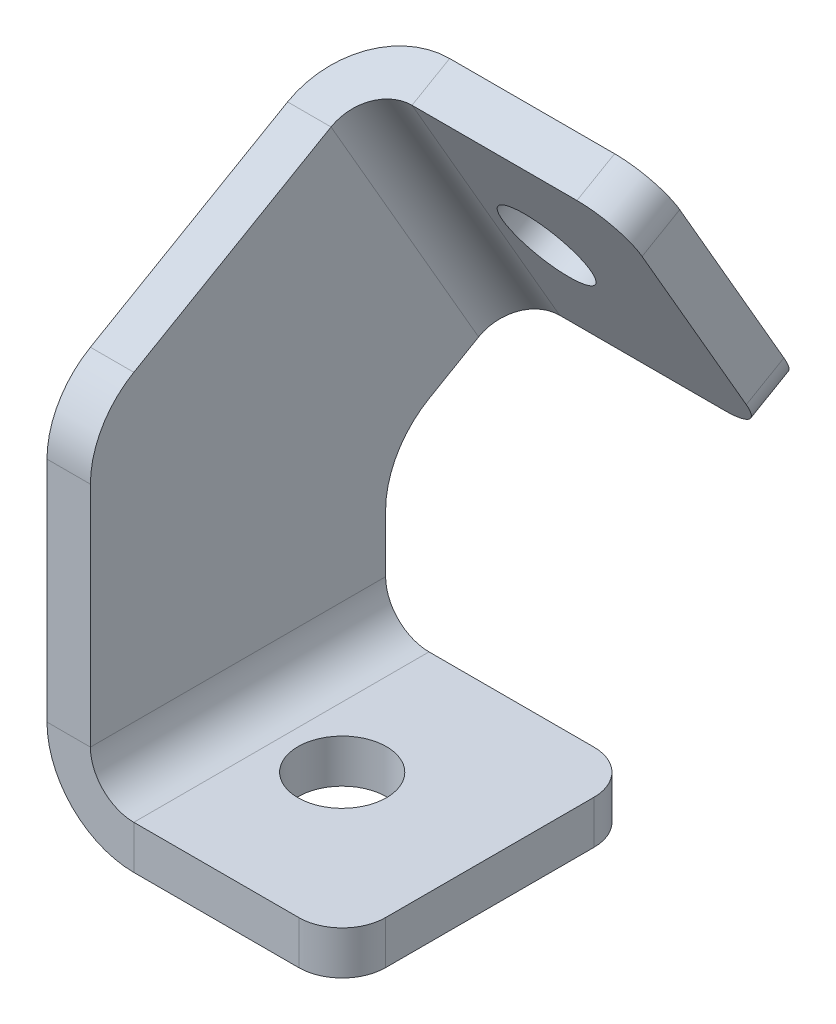
ISO-10303-21;
HEADER;
FILE_DESCRIPTION(('STEP AP214'),'2;1');
FILE_NAME('part.step','',(''),(''),'','','');
FILE_SCHEMA(('AUTOMOTIVE_DESIGN { 1 0 10303 214 1 1 1 1 }'));
ENDSEC;
DATA;
#1=APPLICATION_CONTEXT('core data for automotive mechanical design processes');
#2=APPLICATION_PROTOCOL_DEFINITION('international standard','automotive_design',2000,#1);
#3=PRODUCT_CONTEXT('',#1,'mechanical');
#4=PRODUCT('Part','Part','',(#3));
#5=PRODUCT_RELATED_PRODUCT_CATEGORY('part','',(#4));
#6=PRODUCT_DEFINITION_FORMATION('','',#4);
#7=PRODUCT_DEFINITION_CONTEXT('part definition',#1,'design');
#8=PRODUCT_DEFINITION('design','',#6,#7);
#9=PRODUCT_DEFINITION_SHAPE('','',#8);
#10=(LENGTH_UNIT() NAMED_UNIT(*) SI_UNIT(.MILLI.,.METRE.));
#11=(NAMED_UNIT(*) PLANE_ANGLE_UNIT() SI_UNIT($,.RADIAN.));
#12=(NAMED_UNIT(*) SI_UNIT($,.STERADIAN.) SOLID_ANGLE_UNIT());
#13=UNCERTAINTY_MEASURE_WITH_UNIT(LENGTH_MEASURE(1.E-05),#10,'distance_accuracy_value','');
#14=(GEOMETRIC_REPRESENTATION_CONTEXT(3) GLOBAL_UNCERTAINTY_ASSIGNED_CONTEXT((#13)) GLOBAL_UNIT_ASSIGNED_CONTEXT((#10,
#11,#12)) REPRESENTATION_CONTEXT('',''));
#15=CARTESIAN_POINT('',(0.,0.,0.));
#16=DIRECTION('',(0.,0.,1.));
#17=DIRECTION('',(1.,0.,0.));
#18=AXIS2_PLACEMENT_3D('',#15,#16,#17);
#19=CARTESIAN_POINT('',(2.5,18.1132486540519,12.));
#20=DIRECTION('',(1.,0.,0.));
#21=DIRECTION('',(0.,0.,-1.));
#22=AXIS2_PLACEMENT_3D('',#19,#20,#21);
#23=CYLINDRICAL_SURFACE('',#22,5.);
#24=DIRECTION('',(1.,0.,0.));
#25=VECTOR('',#24,1.);
#26=CARTESIAN_POINT('',(2.5,22.4433756729741,14.5));
#27=LINE('',#26,#25);
#28=CARTESIAN_POINT('',(0.,22.4433756729741,14.5));
#29=VERTEX_POINT('',#28);
#30=CARTESIAN_POINT('',(2.5,22.4433756729741,14.5));
#31=VERTEX_POINT('',#30);
#32=EDGE_CURVE('E10',#29,#31,#27,.T.);
#33=ORIENTED_EDGE('',*,*,#32,.F.);
#34=CARTESIAN_POINT('',(0.,18.1132486540519,12.));
#35=DIRECTION('',(1.,0.,0.));
#36=DIRECTION('',(0.,0.,-1.));
#37=AXIS2_PLACEMENT_3D('',#34,#35,#36);
#38=CIRCLE('',#37,5.);
#39=CARTESIAN_POINT('',(0.,18.1132486540519,17.));
#40=VERTEX_POINT('',#39);
#41=EDGE_CURVE('E136',#29,#40,#38,.T.);
#42=ORIENTED_EDGE('',*,*,#41,.T.);
#43=DIRECTION('',(1.,0.,0.));
#44=VECTOR('',#43,1.);
#45=CARTESIAN_POINT('',(2.5,18.1132486540519,17.));
#46=LINE('',#45,#44);
#47=CARTESIAN_POINT('',(2.5,18.1132486540519,17.));
#48=VERTEX_POINT('',#47);
#49=EDGE_CURVE('E26',#40,#48,#46,.T.);
#50=ORIENTED_EDGE('',*,*,#49,.T.);
#51=CARTESIAN_POINT('',(2.5,18.1132486540519,12.));
#52=DIRECTION('',(1.,0.,0.));
#53=DIRECTION('',(0.,0.,-1.));
#54=AXIS2_PLACEMENT_3D('',#51,#52,#53);
#55=CIRCLE('',#54,5.);
#56=EDGE_CURVE('E254',#31,#48,#55,.T.);
#57=ORIENTED_EDGE('',*,*,#56,.F.);
#58=EDGE_LOOP('',(#33,#42,#50,#57));
#59=FACE_BOUND('',#58,.T.);
#60=ADVANCED_FACE('F16',(#59),#23,.T.);
#61=CARTESIAN_POINT('',(2.5,0.,17.));
#62=DIRECTION('',(0.,0.,-1.));
#63=DIRECTION('',(0.,1.,0.));
#64=AXIS2_PLACEMENT_3D('',#61,#62,#63);
#65=PLANE('',#64);
#66=ORIENTED_EDGE('',*,*,#49,.F.);
#67=DIRECTION('',(0.,1.,0.));
#68=VECTOR('',#67,1.);
#69=CARTESIAN_POINT('',(0.,0.,17.));
#70=LINE('',#69,#68);
#71=CARTESIAN_POINT('',(0.,5.,17.));
#72=VERTEX_POINT('',#71);
#73=EDGE_CURVE('E195',#40,#72,#70,.F.);
#74=ORIENTED_EDGE('',*,*,#73,.T.);
#75=DIRECTION('',(1.,0.,0.));
#76=VECTOR('',#75,1.);
#77=CARTESIAN_POINT('',(2.5,5.,17.));
#78=LINE('',#77,#76);
#79=CARTESIAN_POINT('',(2.5,5.,17.));
#80=VERTEX_POINT('',#79);
#81=EDGE_CURVE('E247',#72,#80,#78,.T.);
#82=ORIENTED_EDGE('',*,*,#81,.T.);
#83=DIRECTION('',(0.,1.,0.));
#84=VECTOR('',#83,1.);
#85=CARTESIAN_POINT('',(2.5,0.,17.));
#86=LINE('',#85,#84);
#87=EDGE_CURVE('E264',#48,#80,#86,.F.);
#88=ORIENTED_EDGE('',*,*,#87,.F.);
#89=EDGE_LOOP('',(#66,#74,#82,#88));
#90=FACE_BOUND('',#89,.T.);
#91=ADVANCED_FACE('F267',(#90),#65,.F.);
#92=CARTESIAN_POINT('',(5.,5.,17.));
#93=DIRECTION('',(0.,0.,1.));
#94=DIRECTION('',(1.,0.,0.));
#95=AXIS2_PLACEMENT_3D('',#92,#93,#94);
#96=PLANE('',#95);
#97=ORIENTED_EDGE('',*,*,#81,.F.);
#98=CARTESIAN_POINT('',(5.,5.,17.));
#99=DIRECTION('',(0.,0.,1.));
#100=DIRECTION('',(1.,0.,0.));
#101=AXIS2_PLACEMENT_3D('',#98,#99,#100);
#102=CIRCLE('',#101,5.);
#103=CARTESIAN_POINT('',(5.,0.,17.));
#104=VERTEX_POINT('',#103);
#105=EDGE_CURVE('E170',#104,#72,#102,.F.);
#106=ORIENTED_EDGE('',*,*,#105,.F.);
#107=DIRECTION('',(0.,1.,0.));
#108=VECTOR('',#107,1.);
#109=CARTESIAN_POINT('',(5.,2.5,17.));
#110=LINE('',#109,#108);
#111=CARTESIAN_POINT('',(5.,2.5,17.));
#112=VERTEX_POINT('',#111);
#113=EDGE_CURVE('E244',#104,#112,#110,.T.);
#114=ORIENTED_EDGE('',*,*,#113,.T.);
#115=CARTESIAN_POINT('',(5.,5.,17.));
#116=DIRECTION('',(0.,0.,-1.));
#117=DIRECTION('',(-1.,0.,0.));
#118=AXIS2_PLACEMENT_3D('',#115,#116,#117);
#119=CIRCLE('',#118,2.5);
#120=EDGE_CURVE('E279',#112,#80,#119,.T.);
#121=ORIENTED_EDGE('',*,*,#120,.T.);
#122=EDGE_LOOP('',(#97,#106,#114,#121));
#123=FACE_BOUND('',#122,.T.);
#124=ADVANCED_FACE('F336',(#123),#96,.T.);
#125=CARTESIAN_POINT('',(0.,2.5,17.));
#126=DIRECTION('',(0.,0.,1.));
#127=DIRECTION('',(1.,0.,0.));
#128=AXIS2_PLACEMENT_3D('',#125,#126,#127);
#129=PLANE('',#128);
#130=ORIENTED_EDGE('',*,*,#113,.F.);
#131=DIRECTION('',(1.,0.,0.));
#132=VECTOR('',#131,1.);
#133=CARTESIAN_POINT('',(0.,0.,17.));
#134=LINE('',#133,#132);
#135=CARTESIAN_POINT('',(14.5,0.,17.));
#136=VERTEX_POINT('',#135);
#137=EDGE_CURVE('E190',#104,#136,#134,.T.);
#138=ORIENTED_EDGE('',*,*,#137,.T.);
#139=DIRECTION('',(0.,1.,0.));
#140=VECTOR('',#139,1.);
#141=CARTESIAN_POINT('',(14.5,2.5,17.));
#142=LINE('',#141,#140);
#143=CARTESIAN_POINT('',(14.5,2.5,17.));
#144=VERTEX_POINT('',#143);
#145=EDGE_CURVE('E241',#136,#144,#142,.T.);
#146=ORIENTED_EDGE('',*,*,#145,.T.);
#147=DIRECTION('',(1.,0.,0.));
#148=VECTOR('',#147,1.);
#149=CARTESIAN_POINT('',(0.,2.5,17.));
#150=LINE('',#149,#148);
#151=EDGE_CURVE('E388',#112,#144,#150,.T.);
#152=ORIENTED_EDGE('',*,*,#151,.F.);
#153=EDGE_LOOP('',(#130,#138,#146,#152));
#154=FACE_BOUND('',#153,.T.);
#155=ADVANCED_FACE('F619',(#154),#129,.T.);
#156=CARTESIAN_POINT('',(14.5,2.5,14.5));
#157=DIRECTION('',(0.,1.,0.));
#158=DIRECTION('',(0.,0.,1.));
#159=AXIS2_PLACEMENT_3D('',#156,#157,#158);
#160=CYLINDRICAL_SURFACE('',#159,2.5);
#161=ORIENTED_EDGE('',*,*,#145,.F.);
#162=CARTESIAN_POINT('',(14.5,0.,14.5));
#163=DIRECTION('',(0.,1.,0.));
#164=DIRECTION('',(0.,0.,1.));
#165=AXIS2_PLACEMENT_3D('',#162,#163,#164);
#166=CIRCLE('',#165,2.5);
#167=CARTESIAN_POINT('',(17.,0.,14.5));
#168=VERTEX_POINT('',#167);
#169=EDGE_CURVE('E166',#136,#168,#166,.T.);
#170=ORIENTED_EDGE('',*,*,#169,.T.);
#171=DIRECTION('',(0.,1.,0.));
#172=VECTOR('',#171,1.);
#173=CARTESIAN_POINT('',(17.,2.5,14.5));
#174=LINE('',#173,#172);
#175=CARTESIAN_POINT('',(17.,2.5,14.5));
#176=VERTEX_POINT('',#175);
#177=EDGE_CURVE('E238',#168,#176,#174,.T.);
#178=ORIENTED_EDGE('',*,*,#177,.T.);
#179=CARTESIAN_POINT('',(14.5,2.5,14.5));
#180=DIRECTION('',(0.,1.,0.));
#181=DIRECTION('',(0.,0.,1.));
#182=AXIS2_PLACEMENT_3D('',#179,#180,#181);
#183=CIRCLE('',#182,2.5);
#184=EDGE_CURVE('E384',#144,#176,#183,.T.);
#185=ORIENTED_EDGE('',*,*,#184,.F.);
#186=EDGE_LOOP('',(#161,#170,#178,#185));
#187=FACE_BOUND('',#186,.T.);
#188=ADVANCED_FACE('F624',(#187),#160,.T.);
#189=CARTESIAN_POINT('',(17.,2.5,17.));
#190=DIRECTION('',(1.,0.,0.));
#191=DIRECTION('',(0.,0.,-1.));
#192=AXIS2_PLACEMENT_3D('',#189,#190,#191);
#193=PLANE('',#192);
#194=ORIENTED_EDGE('',*,*,#177,.F.);
#195=DIRECTION('',(0.,0.,1.));
#196=VECTOR('',#195,1.);
#197=CARTESIAN_POINT('',(17.,0.,17.));
#198=LINE('',#197,#196);
#199=CARTESIAN_POINT('',(17.,0.,2.5));
#200=VERTEX_POINT('',#199);
#201=EDGE_CURVE('E184',#168,#200,#198,.F.);
#202=ORIENTED_EDGE('',*,*,#201,.T.);
#203=DIRECTION('',(0.,1.,0.));
#204=VECTOR('',#203,1.);
#205=CARTESIAN_POINT('',(17.,2.5,2.5));
#206=LINE('',#205,#204);
#207=CARTESIAN_POINT('',(17.,2.5,2.5));
#208=VERTEX_POINT('',#207);
#209=EDGE_CURVE('E235',#200,#208,#206,.T.);
#210=ORIENTED_EDGE('',*,*,#209,.T.);
#211=DIRECTION('',(0.,0.,-1.));
#212=VECTOR('',#211,1.);
#213=CARTESIAN_POINT('',(17.,2.5,17.));
#214=LINE('',#213,#212);
#215=EDGE_CURVE('E401',#176,#208,#214,.T.);
#216=ORIENTED_EDGE('',*,*,#215,.F.);
#217=EDGE_LOOP('',(#194,#202,#210,#216));
#218=FACE_BOUND('',#217,.T.);
#219=ADVANCED_FACE('F650',(#218),#193,.T.);
#220=CARTESIAN_POINT('',(14.5,2.5,2.5));
#221=DIRECTION('',(0.,1.,0.));
#222=DIRECTION('',(0.,0.,1.));
#223=AXIS2_PLACEMENT_3D('',#220,#221,#222);
#224=CYLINDRICAL_SURFACE('',#223,2.5);
#225=ORIENTED_EDGE('',*,*,#209,.F.);
#226=CARTESIAN_POINT('',(14.5,0.,2.5));
#227=DIRECTION('',(0.,1.,0.));
#228=DIRECTION('',(0.,0.,1.));
#229=AXIS2_PLACEMENT_3D('',#226,#227,#228);
#230=CIRCLE('',#229,2.5);
#231=CARTESIAN_POINT('',(14.5,0.,0.));
#232=VERTEX_POINT('',#231);
#233=EDGE_CURVE('E181',#200,#232,#230,.T.);
#234=ORIENTED_EDGE('',*,*,#233,.T.);
#235=DIRECTION('',(0.,1.,0.));
#236=VECTOR('',#235,1.);
#237=CARTESIAN_POINT('',(14.5,2.5,0.));
#238=LINE('',#237,#236);
#239=CARTESIAN_POINT('',(14.5,2.5,0.));
#240=VERTEX_POINT('',#239);
#241=EDGE_CURVE('E232',#232,#240,#238,.T.);
#242=ORIENTED_EDGE('',*,*,#241,.T.);
#243=CARTESIAN_POINT('',(14.5,2.5,2.5));
#244=DIRECTION('',(0.,1.,0.));
#245=DIRECTION('',(0.,0.,1.));
#246=AXIS2_PLACEMENT_3D('',#243,#244,#245);
#247=CIRCLE('',#246,2.5);
#248=EDGE_CURVE('E398',#208,#240,#247,.T.);
#249=ORIENTED_EDGE('',*,*,#248,.F.);
#250=EDGE_LOOP('',(#225,#234,#242,#249));
#251=FACE_BOUND('',#250,.T.);
#252=ADVANCED_FACE('F593',(#251),#224,.T.);
#253=CARTESIAN_POINT('',(0.,2.5,0.));
#254=DIRECTION('',(0.,0.,1.));
#255=DIRECTION('',(1.,0.,0.));
#256=AXIS2_PLACEMENT_3D('',#253,#254,#255);
#257=PLANE('',#256);
#258=ORIENTED_EDGE('',*,*,#241,.F.);
#259=DIRECTION('',(1.,0.,0.));
#260=VECTOR('',#259,1.);
#261=CARTESIAN_POINT('',(0.,0.,0.));
#262=LINE('',#261,#260);
#263=CARTESIAN_POINT('',(5.,0.,0.));
#264=VERTEX_POINT('',#263);
#265=EDGE_CURVE('E178',#264,#232,#262,.T.);
#266=ORIENTED_EDGE('',*,*,#265,.F.);
#267=DIRECTION('',(0.,1.,0.));
#268=VECTOR('',#267,1.);
#269=CARTESIAN_POINT('',(5.,2.5,0.));
#270=LINE('',#269,#268);
#271=CARTESIAN_POINT('',(5.,2.5,0.));
#272=VERTEX_POINT('',#271);
#273=EDGE_CURVE('E229',#264,#272,#270,.T.);
#274=ORIENTED_EDGE('',*,*,#273,.T.);
#275=DIRECTION('',(1.,0.,0.));
#276=VECTOR('',#275,1.);
#277=CARTESIAN_POINT('',(0.,2.5,0.));
#278=LINE('',#277,#276);
#279=EDGE_CURVE('E396',#272,#240,#278,.T.);
#280=ORIENTED_EDGE('',*,*,#279,.T.);
#281=EDGE_LOOP('',(#258,#266,#274,#280));
#282=FACE_BOUND('',#281,.T.);
#283=ADVANCED_FACE('F585',(#282),#257,.F.);
#284=CARTESIAN_POINT('',(5.,5.,0.));
#285=DIRECTION('',(0.,0.,1.));
#286=DIRECTION('',(1.,0.,0.));
#287=AXIS2_PLACEMENT_3D('',#284,#285,#286);
#288=PLANE('',#287);
#289=ORIENTED_EDGE('',*,*,#273,.F.);
#290=CARTESIAN_POINT('',(5.,5.,0.));
#291=DIRECTION('',(0.,0.,1.));
#292=DIRECTION('',(1.,0.,0.));
#293=AXIS2_PLACEMENT_3D('',#290,#291,#292);
#294=CIRCLE('',#293,5.);
#295=CARTESIAN_POINT('',(0.,5.,0.));
#296=VERTEX_POINT('',#295);
#297=EDGE_CURVE('E175',#296,#264,#294,.T.);
#298=ORIENTED_EDGE('',*,*,#297,.F.);
#299=DIRECTION('',(1.,0.,0.));
#300=VECTOR('',#299,1.);
#301=CARTESIAN_POINT('',(2.5,5.,0.));
#302=LINE('',#301,#300);
#303=CARTESIAN_POINT('',(2.5,5.,0.));
#304=VERTEX_POINT('',#303);
#305=EDGE_CURVE('E226',#296,#304,#302,.T.);
#306=ORIENTED_EDGE('',*,*,#305,.T.);
#307=CARTESIAN_POINT('',(5.,5.,0.));
#308=DIRECTION('',(0.,0.,-1.));
#309=DIRECTION('',(-1.,0.,0.));
#310=AXIS2_PLACEMENT_3D('',#307,#308,#309);
#311=CIRCLE('',#310,2.5);
#312=EDGE_CURVE('E281',#304,#272,#311,.F.);
#313=ORIENTED_EDGE('',*,*,#312,.T.);
#314=EDGE_LOOP('',(#289,#298,#306,#313));
#315=FACE_BOUND('',#314,.T.);
#316=ADVANCED_FACE('F319',(#315),#288,.F.);
#317=CARTESIAN_POINT('',(2.5,0.,0.));
#318=DIRECTION('',(0.,0.,-1.));
#319=DIRECTION('',(0.,1.,0.));
#320=AXIS2_PLACEMENT_3D('',#317,#318,#319);
#321=PLANE('',#320);
#322=ORIENTED_EDGE('',*,*,#305,.F.);
#323=DIRECTION('',(0.,1.,0.));
#324=VECTOR('',#323,1.);
#325=CARTESIAN_POINT('',(0.,0.,0.));
#326=LINE('',#325,#324);
#327=CARTESIAN_POINT('',(0.,8.2982940778282,0.));
#328=VERTEX_POINT('',#327);
#329=EDGE_CURVE('E171',#328,#296,#326,.F.);
#330=ORIENTED_EDGE('',*,*,#329,.F.);
#331=DIRECTION('',(1.,0.,0.));
#332=VECTOR('',#331,1.);
#333=CARTESIAN_POINT('',(2.5,8.2982940778282,0.));
#334=LINE('',#333,#332);
#335=CARTESIAN_POINT('',(2.5,8.2982940778282,0.));
#336=VERTEX_POINT('',#335);
#337=EDGE_CURVE('E223',#328,#336,#334,.T.);
#338=ORIENTED_EDGE('',*,*,#337,.T.);
#339=DIRECTION('',(0.,1.,0.));
#340=VECTOR('',#339,1.);
#341=CARTESIAN_POINT('',(2.5,0.,0.));
#342=LINE('',#341,#340);
#343=EDGE_CURVE('E270',#336,#304,#342,.F.);
#344=ORIENTED_EDGE('',*,*,#343,.T.);
#345=EDGE_LOOP('',(#322,#330,#338,#344));
#346=FACE_BOUND('',#345,.T.);
#347=ADVANCED_FACE('F569',(#346),#321,.T.);
#348=CARTESIAN_POINT('',(2.5,8.2982940778282,-5.));
#349=DIRECTION('',(1.,0.,0.));
#350=DIRECTION('',(0.,0.,-1.));
#351=AXIS2_PLACEMENT_3D('',#348,#349,#350);
#352=CYLINDRICAL_SURFACE('',#351,5.);
#353=ORIENTED_EDGE('',*,*,#337,.F.);
#354=CARTESIAN_POINT('',(0.,8.2982940778282,-5.));
#355=DIRECTION('',(1.,0.,0.));
#356=DIRECTION('',(0.,0.,-1.));
#357=AXIS2_PLACEMENT_3D('',#354,#355,#356);
#358=CIRCLE('',#357,5.);
#359=CARTESIAN_POINT('',(0.,12.6284210967504,-2.50000000000001));
#360=VERTEX_POINT('',#359);
#361=EDGE_CURVE('E167',#328,#360,#358,.F.);
#362=ORIENTED_EDGE('',*,*,#361,.T.);
#363=DIRECTION('',(1.,0.,0.));
#364=VECTOR('',#363,1.);
#365=CARTESIAN_POINT('',(2.5,12.6284210967504,-2.50000000000001));
#366=LINE('',#365,#364);
#367=CARTESIAN_POINT('',(2.5,12.6284210967504,-2.50000000000001));
#368=VERTEX_POINT('',#367);
#369=EDGE_CURVE('E220',#360,#368,#366,.T.);
#370=ORIENTED_EDGE('',*,*,#369,.T.);
#371=CARTESIAN_POINT('',(2.5,8.2982940778282,-5.));
#372=DIRECTION('',(1.,0.,0.));
#373=DIRECTION('',(0.,0.,-1.));
#374=AXIS2_PLACEMENT_3D('',#371,#372,#373);
#375=CIRCLE('',#374,5.);
#376=EDGE_CURVE('E276',#336,#368,#375,.F.);
#377=ORIENTED_EDGE('',*,*,#376,.F.);
#378=EDGE_LOOP('',(#353,#362,#370,#377));
#379=FACE_BOUND('',#378,.T.);
#380=ADVANCED_FACE('F561',(#379),#352,.F.);
#381=CARTESIAN_POINT('',(2.5,16.7775681356645,-9.6865334794732));
#382=DIRECTION('',(0.,0.86602540378444,0.499999999999998));
#383=DIRECTION('',(0.,-0.499999999999998,0.86602540378444));
#384=AXIS2_PLACEMENT_3D('',#381,#382,#383);
#385=PLANE('',#384);
#386=ORIENTED_EDGE('',*,*,#369,.F.);
#387=DIRECTION('',(0.,-0.499999999999998,0.86602540378444));
#388=VECTOR('',#387,1.);
#389=CARTESIAN_POINT('',(0.,16.7775681356645,-9.6865334794732));
#390=LINE('',#389,#388);
#391=CARTESIAN_POINT('',(0.,14.2775681356645,-5.35640646055101));
#392=VERTEX_POINT('',#391);
#393=EDGE_CURVE('E132',#360,#392,#390,.F.);
#394=ORIENTED_EDGE('',*,*,#393,.T.);
#395=DIRECTION('',(1.,0.,0.));
#396=VECTOR('',#395,1.);
#397=CARTESIAN_POINT('',(2.5,14.2775681356645,-5.35640646055101));
#398=LINE('',#397,#396);
#399=CARTESIAN_POINT('',(2.5,14.2775681356645,-5.35640646055101));
#400=VERTEX_POINT('',#399);
#401=EDGE_CURVE('E217',#392,#400,#398,.T.);
#402=ORIENTED_EDGE('',*,*,#401,.T.);
#403=DIRECTION('',(0.,-0.499999999999998,0.86602540378444));
#404=VECTOR('',#403,1.);
#405=CARTESIAN_POINT('',(2.5,16.7775681356645,-9.6865334794732));
#406=LINE('',#405,#404);
#407=EDGE_CURVE('E380',#368,#400,#406,.F.);
#408=ORIENTED_EDGE('',*,*,#407,.F.);
#409=EDGE_LOOP('',(#386,#394,#402,#408));
#410=FACE_BOUND('',#409,.T.);
#411=ADVANCED_FACE('F379',(#410),#385,.F.);
#412=CARTESIAN_POINT('',(5.,14.2775681356645,-5.35640646055101));
#413=DIRECTION('',(0.,0.86602540378444,0.499999999999998));
#414=DIRECTION('',(0.,-0.499999999999998,0.86602540378444));
#415=AXIS2_PLACEMENT_3D('',#412,#413,#414);
#416=PLANE('',#415);
#417=ORIENTED_EDGE('',*,*,#401,.F.);
#418=CARTESIAN_POINT('',(5.,14.2775681356645,-5.35640646055101));
#419=DIRECTION('',(0.,0.86602540378444,0.499999999999998));
#420=DIRECTION('',(0.,-0.499999999999998,0.86602540378444));
#421=AXIS2_PLACEMENT_3D('',#418,#419,#420);
#422=CIRCLE('',#421,5.);
#423=CARTESIAN_POINT('',(5.,16.7775681356645,-9.68653347947321));
#424=VERTEX_POINT('',#423);
#425=EDGE_CURVE('E128',#424,#392,#422,.T.);
#426=ORIENTED_EDGE('',*,*,#425,.F.);
#427=DIRECTION('',(0.,-0.499999999999998,0.86602540378444));
#428=VECTOR('',#427,1.);
#429=CARTESIAN_POINT('',(5.,15.5275681356645,-7.52146997001211));
#430=LINE('',#429,#428);
#431=CARTESIAN_POINT('',(5.,15.5275681356645,-7.52146997001211));
#432=VERTEX_POINT('',#431);
#433=EDGE_CURVE('E34',#424,#432,#430,.T.);
#434=ORIENTED_EDGE('',*,*,#433,.T.);
#435=CARTESIAN_POINT('',(5.,14.2775681356645,-5.35640646055101));
#436=DIRECTION('',(0.,-0.86602540378444,-0.499999999999998));
#437=DIRECTION('',(0.,0.499999999999998,-0.86602540378444));
#438=AXIS2_PLACEMENT_3D('',#435,#436,#437);
#439=CIRCLE('',#438,2.5);
#440=EDGE_CURVE('E118',#432,#400,#439,.F.);
#441=ORIENTED_EDGE('',*,*,#440,.T.);
#442=EDGE_LOOP('',(#417,#426,#434,#441));
#443=FACE_BOUND('',#442,.T.);
#444=ADVANCED_FACE('F373',(#443),#416,.F.);
#445=CARTESIAN_POINT('',(0.,15.5275681356645,-7.52146997001211));
#446=DIRECTION('',(0.,-0.86602540378444,-0.499999999999998));
#447=DIRECTION('',(1.,0.,0.));
#448=AXIS2_PLACEMENT_3D('',#445,#446,#447);
#449=PLANE('',#448);
#450=ORIENTED_EDGE('',*,*,#433,.F.);
#451=DIRECTION('',(-1.,0.,0.));
#452=VECTOR('',#451,1.);
#453=CARTESIAN_POINT('',(0.,16.7775681356645,-9.6865334794732));
#454=LINE('',#453,#452);
#455=CARTESIAN_POINT('',(14.5,16.7775681356645,-9.6865334794732));
#456=VERTEX_POINT('',#455);
#457=EDGE_CURVE('E161',#424,#456,#454,.F.);
#458=ORIENTED_EDGE('',*,*,#457,.T.);
#459=DIRECTION('',(0.,-0.499999999999998,0.86602540378444));
#460=VECTOR('',#459,1.);
#461=CARTESIAN_POINT('',(14.5,15.5275681356645,-7.52146997001211));
#462=LINE('',#461,#460);
#463=CARTESIAN_POINT('',(14.5,15.5275681356645,-7.52146997001211));
#464=VERTEX_POINT('',#463);
#465=EDGE_CURVE('E213',#456,#464,#462,.T.);
#466=ORIENTED_EDGE('',*,*,#465,.T.);
#467=DIRECTION('',(1.,0.,0.));
#468=VECTOR('',#467,1.);
#469=CARTESIAN_POINT('',(0.,15.5275681356645,-7.52146997001211));
#470=LINE('',#469,#468);
#471=EDGE_CURVE('E287',#432,#464,#470,.T.);
#472=ORIENTED_EDGE('',*,*,#471,.F.);
#473=EDGE_LOOP('',(#450,#458,#466,#472));
#474=FACE_BOUND('',#473,.T.);
#475=ADVANCED_FACE('F538',(#474),#449,.T.);
#476=CARTESIAN_POINT('',(14.5,17.6926316451256,-6.27146997001211));
#477=DIRECTION('',(0.,-0.499999999999998,0.86602540378444));
#478=DIRECTION('',(0.,-0.86602540378444,-0.499999999999998));
#479=AXIS2_PLACEMENT_3D('',#476,#477,#478);
#480=CYLINDRICAL_SURFACE('',#479,2.5);
#481=ORIENTED_EDGE('',*,*,#465,.F.);
#482=CARTESIAN_POINT('',(14.5,18.9426316451256,-8.43653347947321));
#483=DIRECTION('',(0.,-0.499999999999998,0.86602540378444));
#484=DIRECTION('',(0.,-0.86602540378444,-0.499999999999998));
#485=AXIS2_PLACEMENT_3D('',#482,#483,#484);
#486=CIRCLE('',#485,2.5);
#487=CARTESIAN_POINT('',(17.,18.9426316451256,-8.43653347947321));
#488=VERTEX_POINT('',#487);
#489=EDGE_CURVE('E158',#456,#488,#486,.T.);
#490=ORIENTED_EDGE('',*,*,#489,.T.);
#491=DIRECTION('',(0.,-0.499999999999998,0.86602540378444));
#492=VECTOR('',#491,1.);
#493=CARTESIAN_POINT('',(17.,17.6926316451256,-6.27146997001211));
#494=LINE('',#493,#492);
#495=CARTESIAN_POINT('',(17.,17.6926316451256,-6.27146997001211));
#496=VERTEX_POINT('',#495);
#497=EDGE_CURVE('E210',#488,#496,#494,.T.);
#498=ORIENTED_EDGE('',*,*,#497,.T.);
#499=CARTESIAN_POINT('',(14.5,17.6926316451256,-6.27146997001211));
#500=DIRECTION('',(0.,-0.499999999999998,0.86602540378444));
#501=DIRECTION('',(0.,-0.86602540378444,-0.499999999999998));
#502=AXIS2_PLACEMENT_3D('',#499,#500,#501);
#503=CIRCLE('',#502,2.5);
#504=EDGE_CURVE('E290',#464,#496,#503,.T.);
#505=ORIENTED_EDGE('',*,*,#504,.F.);
#506=EDGE_LOOP('',(#481,#490,#498,#505));
#507=FACE_BOUND('',#506,.T.);
#508=ADVANCED_FACE('F529',(#507),#480,.T.);
#509=CARTESIAN_POINT('',(17.,30.25,0.978530029987858));
#510=DIRECTION('',(-1.,0.,0.));
#511=DIRECTION('',(0.,-0.86602540378444,-0.499999999999998));
#512=AXIS2_PLACEMENT_3D('',#509,#510,#511);
#513=PLANE('',#512);
#514=ORIENTED_EDGE('',*,*,#497,.F.);
#515=DIRECTION('',(0.,0.86602540378444,0.499999999999998));
#516=VECTOR('',#515,1.);
#517=CARTESIAN_POINT('',(17.,31.5,-1.18653347947324));
#518=LINE('',#517,#516);
#519=CARTESIAN_POINT('',(17.,29.3349364905389,-2.43653347947324));
#520=VERTEX_POINT('',#519);
#521=EDGE_CURVE('E155',#520,#488,#518,.F.);
#522=ORIENTED_EDGE('',*,*,#521,.F.);
#523=DIRECTION('',(0.,-0.499999999999998,0.86602540378444));
#524=VECTOR('',#523,1.);
#525=CARTESIAN_POINT('',(17.,28.0849364905389,-0.271469970012137));
#526=LINE('',#525,#524);
#527=CARTESIAN_POINT('',(17.,28.0849364905389,-0.271469970012137));
#528=VERTEX_POINT('',#527);
#529=EDGE_CURVE('E207',#520,#528,#526,.T.);
#530=ORIENTED_EDGE('',*,*,#529,.T.);
#531=DIRECTION('',(0.,-0.86602540378444,-0.499999999999998));
#532=VECTOR('',#531,1.);
#533=CARTESIAN_POINT('',(17.,30.25,0.978530029987858));
#534=LINE('',#533,#532);
#535=EDGE_CURVE('E293',#528,#496,#534,.T.);
#536=ORIENTED_EDGE('',*,*,#535,.T.);
#537=EDGE_LOOP('',(#514,#522,#530,#536));
#538=FACE_BOUND('',#537,.T.);
#539=ADVANCED_FACE('F521',(#538),#513,.F.);
#540=CARTESIAN_POINT('',(14.5,28.0849364905389,-0.271469970012137));
#541=DIRECTION('',(0.,-0.499999999999998,0.86602540378444));
#542=DIRECTION('',(0.,-0.86602540378444,-0.499999999999998));
#543=AXIS2_PLACEMENT_3D('',#540,#541,#542);
#544=CYLINDRICAL_SURFACE('',#543,2.5);
#545=ORIENTED_EDGE('',*,*,#529,.F.);
#546=CARTESIAN_POINT('',(14.5,29.3349364905389,-2.43653347947324));
#547=DIRECTION('',(0.,-0.499999999999998,0.86602540378444));
#548=DIRECTION('',(0.,-0.86602540378444,-0.499999999999998));
#549=AXIS2_PLACEMENT_3D('',#546,#547,#548);
#550=CIRCLE('',#549,2.5);
#551=CARTESIAN_POINT('',(14.5,31.5,-1.18653347947324));
#552=VERTEX_POINT('',#551);
#553=EDGE_CURVE('E152',#520,#552,#550,.T.);
#554=ORIENTED_EDGE('',*,*,#553,.T.);
#555=DIRECTION('',(0.,-0.499999999999998,0.86602540378444));
#556=VECTOR('',#555,1.);
#557=CARTESIAN_POINT('',(14.5,30.25,0.978530029987858));
#558=LINE('',#557,#556);
#559=CARTESIAN_POINT('',(14.5,30.25,0.978530029987858));
#560=VERTEX_POINT('',#559);
#561=EDGE_CURVE('E204',#552,#560,#558,.T.);
#562=ORIENTED_EDGE('',*,*,#561,.T.);
#563=CARTESIAN_POINT('',(14.5,28.0849364905389,-0.271469970012137));
#564=DIRECTION('',(0.,-0.499999999999998,0.86602540378444));
#565=DIRECTION('',(0.,-0.86602540378444,-0.499999999999998));
#566=AXIS2_PLACEMENT_3D('',#563,#564,#565);
#567=CIRCLE('',#566,2.5);
#568=EDGE_CURVE('E296',#528,#560,#567,.T.);
#569=ORIENTED_EDGE('',*,*,#568,.F.);
#570=EDGE_LOOP('',(#545,#554,#562,#569));
#571=FACE_BOUND('',#570,.T.);
#572=ADVANCED_FACE('F359',(#571),#544,.T.);
#573=CARTESIAN_POINT('',(0.,30.25,0.978530029987858));
#574=DIRECTION('',(0.,-0.86602540378444,-0.499999999999998));
#575=DIRECTION('',(1.,0.,0.));
#576=AXIS2_PLACEMENT_3D('',#573,#574,#575);
#577=PLANE('',#576);
#578=ORIENTED_EDGE('',*,*,#561,.F.);
#579=DIRECTION('',(-1.,0.,0.));
#580=VECTOR('',#579,1.);
#581=CARTESIAN_POINT('',(0.,31.5,-1.18653347947324));
#582=LINE('',#581,#580);
#583=CARTESIAN_POINT('',(5.,31.5,-1.18653347947324));
#584=VERTEX_POINT('',#583);
#585=EDGE_CURVE('E144',#584,#552,#582,.F.);
#586=ORIENTED_EDGE('',*,*,#585,.F.);
#587=DIRECTION('',(0.,-0.499999999999998,0.86602540378444));
#588=VECTOR('',#587,1.);
#589=CARTESIAN_POINT('',(5.,30.25,0.978530029987858));
#590=LINE('',#589,#588);
#591=CARTESIAN_POINT('',(5.,30.25,0.978530029987858));
#592=VERTEX_POINT('',#591);
#593=EDGE_CURVE('E117',#584,#592,#590,.T.);
#594=ORIENTED_EDGE('',*,*,#593,.T.);
#595=DIRECTION('',(1.,0.,0.));
#596=VECTOR('',#595,1.);
#597=CARTESIAN_POINT('',(0.,30.25,0.978530029987858));
#598=LINE('',#597,#596);
#599=EDGE_CURVE('E299',#592,#560,#598,.T.);
#600=ORIENTED_EDGE('',*,*,#599,.T.);
#601=EDGE_LOOP('',(#578,#586,#594,#600));
#602=FACE_BOUND('',#601,.T.);
#603=ADVANCED_FACE('F366',(#602),#577,.F.);
#604=CARTESIAN_POINT('',(5.,29.,3.14359353944896));
#605=DIRECTION('',(0.,0.86602540378444,0.499999999999998));
#606=DIRECTION('',(0.,-0.499999999999998,0.86602540378444));
#607=AXIS2_PLACEMENT_3D('',#604,#605,#606);
#608=PLANE('',#607);
#609=ORIENTED_EDGE('',*,*,#593,.F.);
#610=CARTESIAN_POINT('',(5.,29.,3.14359353944896));
#611=DIRECTION('',(0.,0.86602540378444,0.499999999999998));
#612=DIRECTION('',(0.,-0.499999999999998,0.86602540378444));
#613=AXIS2_PLACEMENT_3D('',#610,#611,#612);
#614=CIRCLE('',#613,5.);
#615=CARTESIAN_POINT('',(0.,29.,3.14359353944896));
#616=VERTEX_POINT('',#615);
#617=EDGE_CURVE('E126',#616,#584,#614,.F.);
#618=ORIENTED_EDGE('',*,*,#617,.F.);
#619=DIRECTION('',(1.,0.,0.));
#620=VECTOR('',#619,1.);
#621=CARTESIAN_POINT('',(2.5,29.,3.14359353944896));
#622=LINE('',#621,#620);
#623=CARTESIAN_POINT('',(2.5,29.,3.14359353944896));
#624=VERTEX_POINT('',#623);
#625=EDGE_CURVE('E20',#616,#624,#622,.T.);
#626=ORIENTED_EDGE('',*,*,#625,.T.);
#627=CARTESIAN_POINT('',(5.,29.,3.14359353944896));
#628=DIRECTION('',(0.,-0.86602540378444,-0.499999999999998));
#629=DIRECTION('',(0.,0.499999999999998,-0.86602540378444));
#630=AXIS2_PLACEMENT_3D('',#627,#628,#629);
#631=CIRCLE('',#630,2.5);
#632=EDGE_CURVE('E305',#624,#592,#631,.T.);
#633=ORIENTED_EDGE('',*,*,#632,.T.);
#634=EDGE_LOOP('',(#609,#618,#626,#633));
#635=FACE_BOUND('',#634,.T.);
#636=ADVANCED_FACE('F138',(#635),#608,.T.);
#637=CARTESIAN_POINT('',(8.5,2.5,8.5));
#638=DIRECTION('',(0.,1.,0.));
#639=DIRECTION('',(0.,0.,1.));
#640=AXIS2_PLACEMENT_3D('',#637,#638,#639);
#641=CYLINDRICAL_SURFACE('',#640,2.55);
#642=CARTESIAN_POINT('',(8.5,2.5,8.5));
#643=DIRECTION('',(0.,1.,0.));
#644=DIRECTION('',(0.,0.,1.));
#645=AXIS2_PLACEMENT_3D('',#642,#643,#644);
#646=CIRCLE('',#645,2.55);
#647=CARTESIAN_POINT('',(8.5,2.5,11.05));
#648=VERTEX_POINT('',#647);
#649=EDGE_CURVE('E142',#648,#648,#646,.F.);
#650=ORIENTED_EDGE('',*,*,#649,.F.);
#651=EDGE_LOOP('',(#650));
#652=FACE_BOUND('',#651,.T.);
#653=CARTESIAN_POINT('',(8.5,0.,8.5));
#654=DIRECTION('',(0.,1.,0.));
#655=DIRECTION('',(0.,0.,1.));
#656=AXIS2_PLACEMENT_3D('',#653,#654,#655);
#657=CIRCLE('',#656,2.55);
#658=CARTESIAN_POINT('',(8.5,0.,11.05));
#659=VERTEX_POINT('',#658);
#660=EDGE_CURVE('E187',#659,#659,#657,.F.);
#661=ORIENTED_EDGE('',*,*,#660,.T.);
#662=EDGE_LOOP('',(#661));
#663=FACE_BOUND('',#662,.T.);
#664=ADVANCED_FACE('F18',(#652,#663),#641,.F.);
#665=CARTESIAN_POINT('',(8.5,22.8887840678322,-3.27146997001213));
#666=DIRECTION('',(0.,-0.499999999999998,0.86602540378444));
#667=DIRECTION('',(0.,-0.86602540378444,-0.499999999999998));
#668=AXIS2_PLACEMENT_3D('',#665,#666,#667);
#669=CYLINDRICAL_SURFACE('',#668,2.55);
#670=CARTESIAN_POINT('',(8.5,22.8887840678322,-3.27146997001213));
#671=DIRECTION('',(0.,0.499999999999998,-0.86602540378444));
#672=DIRECTION('',(0.,0.86602540378444,0.499999999999998));
#673=AXIS2_PLACEMENT_3D('',#670,#671,#672);
#674=CIRCLE('',#673,2.55);
#675=CARTESIAN_POINT('',(8.5,25.0971488474826,-1.99646997001213));
#676=VERTEX_POINT('',#675);
#677=EDGE_CURVE('E284',#676,#676,#674,.F.);
#678=ORIENTED_EDGE('',*,*,#677,.T.);
#679=EDGE_LOOP('',(#678));
#680=FACE_BOUND('',#679,.T.);
#681=CARTESIAN_POINT('',(8.5,24.1387840678322,-5.43653347947322));
#682=DIRECTION('',(0.,0.499999999999998,-0.86602540378444));
#683=DIRECTION('',(0.,0.86602540378444,0.499999999999998));
#684=AXIS2_PLACEMENT_3D('',#681,#682,#683);
#685=CIRCLE('',#684,2.55);
#686=CARTESIAN_POINT('',(8.5,26.3471488474825,-4.16153347947323));
#687=VERTEX_POINT('',#686);
#688=EDGE_CURVE('E163',#687,#687,#685,.F.);
#689=ORIENTED_EDGE('',*,*,#688,.F.);
#690=EDGE_LOOP('',(#689));
#691=FACE_BOUND('',#690,.T.);
#692=ADVANCED_FACE('F412',(#680,#691),#669,.F.);
#693=CARTESIAN_POINT('',(2.5,31.5,-1.18653347947324));
#694=DIRECTION('',(0.,0.86602540378444,0.499999999999998));
#695=DIRECTION('',(0.,-0.499999999999998,0.86602540378444));
#696=AXIS2_PLACEMENT_3D('',#693,#694,#695);
#697=PLANE('',#696);
#698=DIRECTION('',(0.,-0.499999999999998,0.86602540378444));
#699=VECTOR('',#698,1.);
#700=CARTESIAN_POINT('',(0.,31.5,-1.18653347947324));
#701=LINE('',#700,#699);
#702=EDGE_CURVE('E108',#29,#616,#701,.F.);
#703=ORIENTED_EDGE('',*,*,#702,.F.);
#704=ORIENTED_EDGE('',*,*,#32,.T.);
#705=DIRECTION('',(0.,-0.499999999999998,0.86602540378444));
#706=VECTOR('',#705,1.);
#707=CARTESIAN_POINT('',(2.5,31.5,-1.18653347947324));
#708=LINE('',#707,#706);
#709=EDGE_CURVE('E111',#31,#624,#708,.F.);
#710=ORIENTED_EDGE('',*,*,#709,.T.);
#711=ORIENTED_EDGE('',*,*,#625,.F.);
#712=EDGE_LOOP('',(#703,#704,#710,#711));
#713=FACE_BOUND('',#712,.T.);
#714=ADVANCED_FACE('F106',(#713),#697,.T.);
#715=CARTESIAN_POINT('',(5.,29.,3.14359353944896));
#716=DIRECTION('',(0.,0.86602540378444,0.499999999999998));
#717=DIRECTION('',(0.,-0.499999999999998,0.86602540378444));
#718=AXIS2_PLACEMENT_3D('',#715,#716,#717);
#719=CYLINDRICAL_SURFACE('',#718,2.5);
#720=ORIENTED_EDGE('',*,*,#632,.F.);
#721=DIRECTION('',(0.,-0.86602540378444,-0.499999999999998));
#722=VECTOR('',#721,1.);
#723=CARTESIAN_POINT('',(2.5,29.,3.14359353944896));
#724=LINE('',#723,#722);
#725=EDGE_CURVE('E383',#400,#624,#724,.F.);
#726=ORIENTED_EDGE('',*,*,#725,.F.);
#727=ORIENTED_EDGE('',*,*,#440,.F.);
#728=DIRECTION('',(0.,-0.86602540378444,-0.499999999999998));
#729=VECTOR('',#728,1.);
#730=CARTESIAN_POINT('',(5.,15.5275681356645,-7.52146997001211));
#731=LINE('',#730,#729);
#732=EDGE_CURVE('E302',#592,#432,#731,.T.);
#733=ORIENTED_EDGE('',*,*,#732,.F.);
#734=EDGE_LOOP('',(#720,#726,#727,#733));
#735=FACE_BOUND('',#734,.T.);
#736=ADVANCED_FACE('F432',(#735),#719,.F.);
#737=CARTESIAN_POINT('',(0.,30.25,0.978530029987858));
#738=DIRECTION('',(0.,-0.499999999999998,0.86602540378444));
#739=DIRECTION('',(0.,0.86602540378444,0.499999999999998));
#740=AXIS2_PLACEMENT_3D('',#737,#738,#739);
#741=PLANE('',#740);
#742=ORIENTED_EDGE('',*,*,#677,.F.);
#743=EDGE_LOOP('',(#742));
#744=FACE_BOUND('',#743,.T.);
#745=ORIENTED_EDGE('',*,*,#471,.T.);
#746=ORIENTED_EDGE('',*,*,#504,.T.);
#747=ORIENTED_EDGE('',*,*,#535,.F.);
#748=ORIENTED_EDGE('',*,*,#568,.T.);
#749=ORIENTED_EDGE('',*,*,#599,.F.);
#750=ORIENTED_EDGE('',*,*,#732,.T.);
#751=EDGE_LOOP('',(#745,#746,#747,#748,#749,#750));
#752=FACE_BOUND('',#751,.T.);
#753=ADVANCED_FACE('F365',(#744,#752),#741,.T.);
#754=CARTESIAN_POINT('',(5.,5.,17.));
#755=DIRECTION('',(0.,0.,1.));
#756=DIRECTION('',(1.,0.,0.));
#757=AXIS2_PLACEMENT_3D('',#754,#755,#756);
#758=CYLINDRICAL_SURFACE('',#757,2.5);
#759=ORIENTED_EDGE('',*,*,#120,.F.);
#760=DIRECTION('',(0.,0.,-1.));
#761=VECTOR('',#760,1.);
#762=CARTESIAN_POINT('',(5.,2.5,17.));
#763=LINE('',#762,#761);
#764=EDGE_CURVE('E393',#272,#112,#763,.F.);
#765=ORIENTED_EDGE('',*,*,#764,.F.);
#766=ORIENTED_EDGE('',*,*,#312,.F.);
#767=DIRECTION('',(0.,0.,-1.));
#768=VECTOR('',#767,1.);
#769=CARTESIAN_POINT('',(2.5,5.,0.));
#770=LINE('',#769,#768);
#771=EDGE_CURVE('E268',#80,#304,#770,.T.);
#772=ORIENTED_EDGE('',*,*,#771,.F.);
#773=EDGE_LOOP('',(#759,#765,#766,#772));
#774=FACE_BOUND('',#773,.T.);
#775=ADVANCED_FACE('F343',(#774),#758,.F.);
#776=CARTESIAN_POINT('',(2.5,0.,17.));
#777=DIRECTION('',(1.,0.,0.));
#778=DIRECTION('',(0.,0.,-1.));
#779=AXIS2_PLACEMENT_3D('',#776,#777,#778);
#780=PLANE('',#779);
#781=ORIENTED_EDGE('',*,*,#407,.T.);
#782=ORIENTED_EDGE('',*,*,#725,.T.);
#783=ORIENTED_EDGE('',*,*,#709,.F.);
#784=ORIENTED_EDGE('',*,*,#56,.T.);
#785=ORIENTED_EDGE('',*,*,#87,.T.);
#786=ORIENTED_EDGE('',*,*,#771,.T.);
#787=ORIENTED_EDGE('',*,*,#343,.F.);
#788=ORIENTED_EDGE('',*,*,#376,.T.);
#789=EDGE_LOOP('',(#781,#782,#783,#784,#785,#786,#787,#788));
#790=FACE_BOUND('',#789,.T.);
#791=ADVANCED_FACE('F262',(#790),#780,.T.);
#792=CARTESIAN_POINT('',(0.,2.5,17.));
#793=DIRECTION('',(0.,1.,0.));
#794=DIRECTION('',(0.,0.,1.));
#795=AXIS2_PLACEMENT_3D('',#792,#793,#794);
#796=PLANE('',#795);
#797=ORIENTED_EDGE('',*,*,#649,.T.);
#798=EDGE_LOOP('',(#797));
#799=FACE_BOUND('',#798,.T.);
#800=ORIENTED_EDGE('',*,*,#215,.T.);
#801=ORIENTED_EDGE('',*,*,#248,.T.);
#802=ORIENTED_EDGE('',*,*,#279,.F.);
#803=ORIENTED_EDGE('',*,*,#764,.T.);
#804=ORIENTED_EDGE('',*,*,#151,.T.);
#805=ORIENTED_EDGE('',*,*,#184,.T.);
#806=EDGE_LOOP('',(#800,#801,#802,#803,#804,#805));
#807=FACE_BOUND('',#806,.T.);
#808=ADVANCED_FACE('F407',(#799,#807),#796,.T.);
#809=CARTESIAN_POINT('',(5.,29.,3.14359353944896));
#810=DIRECTION('',(0.,0.86602540378444,0.499999999999998));
#811=DIRECTION('',(0.,-0.499999999999998,0.86602540378444));
#812=AXIS2_PLACEMENT_3D('',#809,#810,#811);
#813=CYLINDRICAL_SURFACE('',#812,5.);
#814=ORIENTED_EDGE('',*,*,#617,.T.);
#815=DIRECTION('',(0.,0.86602540378444,0.499999999999998));
#816=VECTOR('',#815,1.);
#817=CARTESIAN_POINT('',(5.,31.5,-1.18653347947324));
#818=LINE('',#817,#816);
#819=EDGE_CURVE('E140',#584,#424,#818,.F.);
#820=ORIENTED_EDGE('',*,*,#819,.T.);
#821=ORIENTED_EDGE('',*,*,#425,.T.);
#822=DIRECTION('',(0.,0.86602540378444,0.499999999999998));
#823=VECTOR('',#822,1.);
#824=CARTESIAN_POINT('',(0.,29.,3.14359353944895));
#825=LINE('',#824,#823);
#826=EDGE_CURVE('E123',#392,#616,#825,.T.);
#827=ORIENTED_EDGE('',*,*,#826,.T.);
#828=EDGE_LOOP('',(#814,#820,#821,#827));
#829=FACE_BOUND('',#828,.T.);
#830=ADVANCED_FACE('F124',(#829),#813,.T.);
#831=CARTESIAN_POINT('',(0.,31.5,-1.18653347947324));
#832=DIRECTION('',(0.,-0.499999999999998,0.86602540378444));
#833=DIRECTION('',(0.,0.86602540378444,0.499999999999998));
#834=AXIS2_PLACEMENT_3D('',#831,#832,#833);
#835=PLANE('',#834);
#836=ORIENTED_EDGE('',*,*,#688,.T.);
#837=EDGE_LOOP('',(#836));
#838=FACE_BOUND('',#837,.T.);
#839=ORIENTED_EDGE('',*,*,#457,.F.);
#840=ORIENTED_EDGE('',*,*,#819,.F.);
#841=ORIENTED_EDGE('',*,*,#585,.T.);
#842=ORIENTED_EDGE('',*,*,#553,.F.);
#843=ORIENTED_EDGE('',*,*,#521,.T.);
#844=ORIENTED_EDGE('',*,*,#489,.F.);
#845=EDGE_LOOP('',(#839,#840,#841,#842,#843,#844));
#846=FACE_BOUND('',#845,.T.);
#847=ADVANCED_FACE('F369',(#838,#846),#835,.F.);
#848=CARTESIAN_POINT('',(5.,5.,17.));
#849=DIRECTION('',(0.,0.,1.));
#850=DIRECTION('',(1.,0.,0.));
#851=AXIS2_PLACEMENT_3D('',#848,#849,#850);
#852=CYLINDRICAL_SURFACE('',#851,5.);
#853=ORIENTED_EDGE('',*,*,#105,.T.);
#854=DIRECTION('',(0.,0.,-1.));
#855=VECTOR('',#854,1.);
#856=CARTESIAN_POINT('',(0.,5.,17.));
#857=LINE('',#856,#855);
#858=EDGE_CURVE('E174',#72,#296,#857,.T.);
#859=ORIENTED_EDGE('',*,*,#858,.T.);
#860=ORIENTED_EDGE('',*,*,#297,.T.);
#861=DIRECTION('',(0.,0.,1.));
#862=VECTOR('',#861,1.);
#863=CARTESIAN_POINT('',(5.,0.,17.));
#864=LINE('',#863,#862);
#865=EDGE_CURVE('E148',#264,#104,#864,.T.);
#866=ORIENTED_EDGE('',*,*,#865,.T.);
#867=EDGE_LOOP('',(#853,#859,#860,#866));
#868=FACE_BOUND('',#867,.T.);
#869=ADVANCED_FACE('F310',(#868),#852,.T.);
#870=CARTESIAN_POINT('',(0.,0.,17.));
#871=DIRECTION('',(1.,0.,0.));
#872=DIRECTION('',(0.,0.,-1.));
#873=AXIS2_PLACEMENT_3D('',#870,#871,#872);
#874=PLANE('',#873);
#875=ORIENTED_EDGE('',*,*,#393,.F.);
#876=ORIENTED_EDGE('',*,*,#361,.F.);
#877=ORIENTED_EDGE('',*,*,#329,.T.);
#878=ORIENTED_EDGE('',*,*,#858,.F.);
#879=ORIENTED_EDGE('',*,*,#73,.F.);
#880=ORIENTED_EDGE('',*,*,#41,.F.);
#881=ORIENTED_EDGE('',*,*,#702,.T.);
#882=ORIENTED_EDGE('',*,*,#826,.F.);
#883=EDGE_LOOP('',(#875,#876,#877,#878,#879,#880,#881,#882));
#884=FACE_BOUND('',#883,.T.);
#885=ADVANCED_FACE('F134',(#884),#874,.F.);
#886=CARTESIAN_POINT('',(0.,0.,17.));
#887=DIRECTION('',(0.,1.,0.));
#888=DIRECTION('',(0.,0.,1.));
#889=AXIS2_PLACEMENT_3D('',#886,#887,#888);
#890=PLANE('',#889);
#891=ORIENTED_EDGE('',*,*,#660,.F.);
#892=EDGE_LOOP('',(#891));
#893=FACE_BOUND('',#892,.T.);
#894=ORIENTED_EDGE('',*,*,#201,.F.);
#895=ORIENTED_EDGE('',*,*,#169,.F.);
#896=ORIENTED_EDGE('',*,*,#137,.F.);
#897=ORIENTED_EDGE('',*,*,#865,.F.);
#898=ORIENTED_EDGE('',*,*,#265,.T.);
#899=ORIENTED_EDGE('',*,*,#233,.F.);
#900=EDGE_LOOP('',(#894,#895,#896,#897,#898,#899));
#901=FACE_BOUND('',#900,.T.);
#902=ADVANCED_FACE('F331',(#893,#901),#890,.F.);
#903=CLOSED_SHELL('',(#60,#91,#124,#155,#188,#219,#252,#283,#316,#347,#380,#411,#444,#475,#508,
#539,#572,#603,#636,#664,#692,#714,#736,#753,#775,#791,#808,#830,#847,#869,#885,#902));
#904=MANIFOLD_SOLID_BREP('B1',#903);
#905=ADVANCED_BREP_SHAPE_REPRESENTATION('',(#18,#904),#14);
#906=SHAPE_DEFINITION_REPRESENTATION(#9,#905);
ENDSEC;
END-ISO-10303-21;
